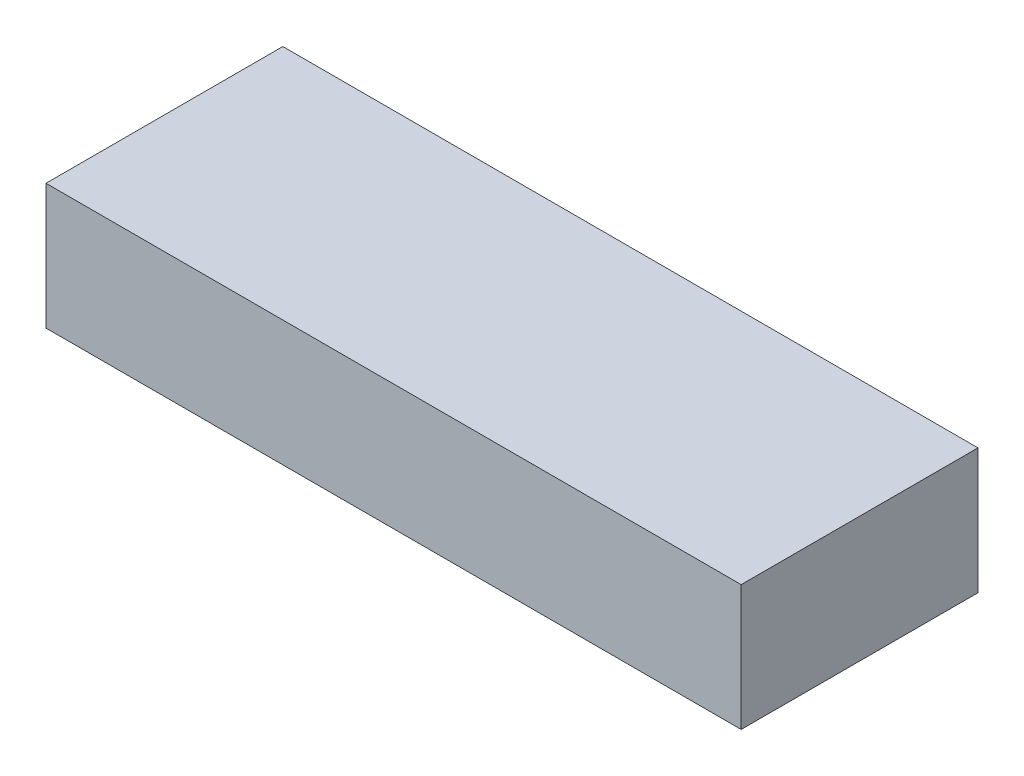
ISO-10303-21;
HEADER;
FILE_DESCRIPTION(('STEP AP214'),'2;1');
FILE_NAME('part.step','',(''),(''),'','','');
FILE_SCHEMA(('AUTOMOTIVE_DESIGN { 1 0 10303 214 1 1 1 1 }'));
ENDSEC;
DATA;
#1=APPLICATION_CONTEXT('core data for automotive mechanical design processes');
#2=APPLICATION_PROTOCOL_DEFINITION('international standard','automotive_design',2000,#1);
#3=PRODUCT_CONTEXT('',#1,'mechanical');
#4=PRODUCT('Part','Part','',(#3));
#5=PRODUCT_RELATED_PRODUCT_CATEGORY('part','',(#4));
#6=PRODUCT_DEFINITION_FORMATION('','',#4);
#7=PRODUCT_DEFINITION_CONTEXT('part definition',#1,'design');
#8=PRODUCT_DEFINITION('design','',#6,#7);
#9=PRODUCT_DEFINITION_SHAPE('','',#8);
#10=(LENGTH_UNIT() NAMED_UNIT(*) SI_UNIT(.MILLI.,.METRE.));
#11=(NAMED_UNIT(*) PLANE_ANGLE_UNIT() SI_UNIT($,.RADIAN.));
#12=(NAMED_UNIT(*) SI_UNIT($,.STERADIAN.) SOLID_ANGLE_UNIT());
#13=UNCERTAINTY_MEASURE_WITH_UNIT(LENGTH_MEASURE(1.E-05),#10,'distance_accuracy_value','');
#14=(GEOMETRIC_REPRESENTATION_CONTEXT(3) GLOBAL_UNCERTAINTY_ASSIGNED_CONTEXT((#13)) GLOBAL_UNIT_ASSIGNED_CONTEXT((#10,
#11,#12)) REPRESENTATION_CONTEXT('',''));
#15=CARTESIAN_POINT('',(0.,0.,0.));
#16=DIRECTION('',(0.,0.,1.));
#17=DIRECTION('',(1.,0.,0.));
#18=AXIS2_PLACEMENT_3D('',#15,#16,#17);
#19=CARTESIAN_POINT('',(68.961,24.892,-23.495));
#20=DIRECTION('',(-1.,0.,0.));
#21=DIRECTION('',(0.,0.,1.));
#22=AXIS2_PLACEMENT_3D('',#19,#20,#21);
#23=PLANE('',#22);
#24=DIRECTION('',(0.,0.,-1.));
#25=VECTOR('',#24,1.);
#26=CARTESIAN_POINT('',(68.961,0.,-23.495));
#27=LINE('',#26,#25);
#28=CARTESIAN_POINT('',(68.961,0.,23.495));
#29=VERTEX_POINT('',#28);
#30=CARTESIAN_POINT('',(68.961,0.,-23.495));
#31=VERTEX_POINT('',#30);
#32=EDGE_CURVE('E107',#29,#31,#27,.T.);
#33=ORIENTED_EDGE('',*,*,#32,.T.);
#34=DIRECTION('',(0.,-1.,0.));
#35=VECTOR('',#34,1.);
#36=CARTESIAN_POINT('',(68.961,24.892,-23.495));
#37=LINE('',#36,#35);
#38=CARTESIAN_POINT('',(68.961,24.892,-23.495));
#39=VERTEX_POINT('',#38);
#40=EDGE_CURVE('E11',#39,#31,#37,.T.);
#41=ORIENTED_EDGE('',*,*,#40,.F.);
#42=DIRECTION('',(0.,0.,-1.));
#43=VECTOR('',#42,1.);
#44=CARTESIAN_POINT('',(68.961,24.892,-23.495));
#45=LINE('',#44,#43);
#46=CARTESIAN_POINT('',(68.961,24.892,23.495));
#47=VERTEX_POINT('',#46);
#48=EDGE_CURVE('E91',#47,#39,#45,.T.);
#49=ORIENTED_EDGE('',*,*,#48,.F.);
#50=DIRECTION('',(0.,-1.,0.));
#51=VECTOR('',#50,1.);
#52=CARTESIAN_POINT('',(68.961,24.892,23.495));
#53=LINE('',#52,#51);
#54=EDGE_CURVE('E103',#47,#29,#53,.T.);
#55=ORIENTED_EDGE('',*,*,#54,.T.);
#56=EDGE_LOOP('',(#33,#41,#49,#55));
#57=FACE_BOUND('',#56,.T.);
#58=ADVANCED_FACE('F39',(#57),#23,.F.);
#59=CARTESIAN_POINT('',(-68.961,24.892,-23.495));
#60=DIRECTION('',(0.,0.,1.));
#61=DIRECTION('',(1.,0.,0.));
#62=AXIS2_PLACEMENT_3D('',#59,#60,#61);
#63=PLANE('',#62);
#64=DIRECTION('',(-1.,0.,0.));
#65=VECTOR('',#64,1.);
#66=CARTESIAN_POINT('',(-68.961,0.,-23.495));
#67=LINE('',#66,#65);
#68=CARTESIAN_POINT('',(-68.961,0.,-23.495));
#69=VERTEX_POINT('',#68);
#70=EDGE_CURVE('E96',#31,#69,#67,.T.);
#71=ORIENTED_EDGE('',*,*,#70,.T.);
#72=DIRECTION('',(0.,-1.,0.));
#73=VECTOR('',#72,1.);
#74=CARTESIAN_POINT('',(-68.961,24.892,-23.495));
#75=LINE('',#74,#73);
#76=CARTESIAN_POINT('',(-68.961,24.892,-23.495));
#77=VERTEX_POINT('',#76);
#78=EDGE_CURVE('E48',#77,#69,#75,.T.);
#79=ORIENTED_EDGE('',*,*,#78,.F.);
#80=DIRECTION('',(-1.,0.,0.));
#81=VECTOR('',#80,1.);
#82=CARTESIAN_POINT('',(-68.961,24.892,-23.495));
#83=LINE('',#82,#81);
#84=EDGE_CURVE('E86',#39,#77,#83,.T.);
#85=ORIENTED_EDGE('',*,*,#84,.F.);
#86=ORIENTED_EDGE('',*,*,#40,.T.);
#87=EDGE_LOOP('',(#71,#79,#85,#86));
#88=FACE_BOUND('',#87,.T.);
#89=ADVANCED_FACE('F95',(#88),#63,.F.);
#90=CARTESIAN_POINT('',(-68.961,24.892,-23.495));
#91=DIRECTION('',(1.,0.,0.));
#92=DIRECTION('',(0.,0.,-1.));
#93=AXIS2_PLACEMENT_3D('',#90,#91,#92);
#94=PLANE('',#93);
#95=DIRECTION('',(0.,0.,1.));
#96=VECTOR('',#95,1.);
#97=CARTESIAN_POINT('',(-68.961,0.,-23.495));
#98=LINE('',#97,#96);
#99=CARTESIAN_POINT('',(-68.961,0.,23.495));
#100=VERTEX_POINT('',#99);
#101=EDGE_CURVE('E73',#69,#100,#98,.T.);
#102=ORIENTED_EDGE('',*,*,#101,.T.);
#103=DIRECTION('',(0.,-1.,0.));
#104=VECTOR('',#103,1.);
#105=CARTESIAN_POINT('',(-68.961,24.892,23.495));
#106=LINE('',#105,#104);
#107=CARTESIAN_POINT('',(-68.961,24.892,23.495));
#108=VERTEX_POINT('',#107);
#109=EDGE_CURVE('E98',#108,#100,#106,.T.);
#110=ORIENTED_EDGE('',*,*,#109,.F.);
#111=DIRECTION('',(0.,0.,1.));
#112=VECTOR('',#111,1.);
#113=CARTESIAN_POINT('',(-68.961,24.892,-23.495));
#114=LINE('',#113,#112);
#115=EDGE_CURVE('E89',#77,#108,#114,.T.);
#116=ORIENTED_EDGE('',*,*,#115,.F.);
#117=ORIENTED_EDGE('',*,*,#78,.T.);
#118=EDGE_LOOP('',(#102,#110,#116,#117));
#119=FACE_BOUND('',#118,.T.);
#120=ADVANCED_FACE('F99',(#119),#94,.F.);
#121=CARTESIAN_POINT('',(-68.961,24.892,23.495));
#122=DIRECTION('',(0.,0.,-1.));
#123=DIRECTION('',(-1.,0.,0.));
#124=AXIS2_PLACEMENT_3D('',#121,#122,#123);
#125=PLANE('',#124);
#126=DIRECTION('',(1.,0.,0.));
#127=VECTOR('',#126,1.);
#128=CARTESIAN_POINT('',(-68.961,0.,23.495));
#129=LINE('',#128,#127);
#130=EDGE_CURVE('E79',#100,#29,#129,.T.);
#131=ORIENTED_EDGE('',*,*,#130,.T.);
#132=ORIENTED_EDGE('',*,*,#54,.F.);
#133=DIRECTION('',(1.,0.,0.));
#134=VECTOR('',#133,1.);
#135=CARTESIAN_POINT('',(-68.961,24.892,23.495));
#136=LINE('',#135,#134);
#137=EDGE_CURVE('E56',#108,#47,#136,.T.);
#138=ORIENTED_EDGE('',*,*,#137,.F.);
#139=ORIENTED_EDGE('',*,*,#109,.T.);
#140=EDGE_LOOP('',(#131,#132,#138,#139));
#141=FACE_BOUND('',#140,.T.);
#142=ADVANCED_FACE('F120',(#141),#125,.F.);
#143=CARTESIAN_POINT('',(0.,24.892,0.));
#144=DIRECTION('',(0.,1.,0.));
#145=DIRECTION('',(0.,0.,1.));
#146=AXIS2_PLACEMENT_3D('',#143,#144,#145);
#147=PLANE('',#146);
#148=ORIENTED_EDGE('',*,*,#48,.T.);
#149=ORIENTED_EDGE('',*,*,#84,.T.);
#150=ORIENTED_EDGE('',*,*,#115,.T.);
#151=ORIENTED_EDGE('',*,*,#137,.T.);
#152=EDGE_LOOP('',(#148,#149,#150,#151));
#153=FACE_BOUND('',#152,.T.);
#154=ADVANCED_FACE('F87',(#153),#147,.T.);
#155=CARTESIAN_POINT('',(0.,0.,0.));
#156=DIRECTION('',(0.,1.,0.));
#157=DIRECTION('',(0.,0.,1.));
#158=AXIS2_PLACEMENT_3D('',#155,#156,#157);
#159=PLANE('',#158);
#160=ORIENTED_EDGE('',*,*,#32,.F.);
#161=ORIENTED_EDGE('',*,*,#130,.F.);
#162=ORIENTED_EDGE('',*,*,#101,.F.);
#163=ORIENTED_EDGE('',*,*,#70,.F.);
#164=EDGE_LOOP('',(#160,#161,#162,#163));
#165=FACE_BOUND('',#164,.T.);
#166=ADVANCED_FACE('F123',(#165),#159,.F.);
#167=CLOSED_SHELL('',(#58,#89,#120,#142,#154,#166));
#168=MANIFOLD_SOLID_BREP('B2',#167);
#169=ADVANCED_BREP_SHAPE_REPRESENTATION('',(#18,#168),#14);
#170=SHAPE_DEFINITION_REPRESENTATION(#9,#169);
ENDSEC;
END-ISO-10303-21;
